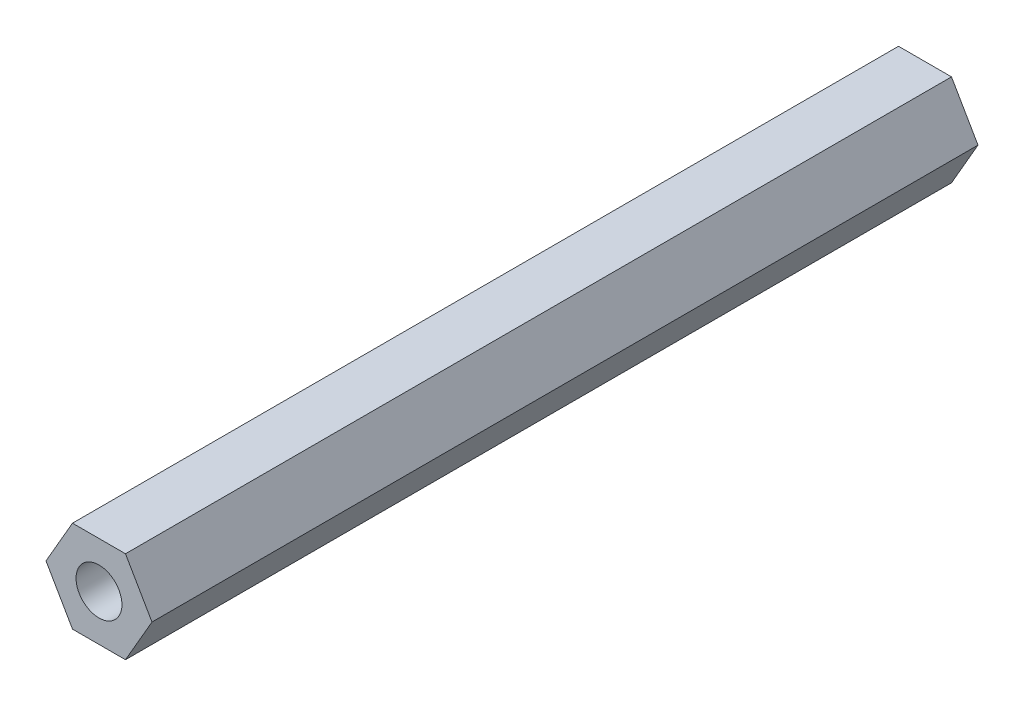
ISO-10303-21;
HEADER;
FILE_DESCRIPTION(('STEP AP214'),'2;1');
FILE_NAME('part.step','',(''),(''),'','','');
FILE_SCHEMA(('AUTOMOTIVE_DESIGN { 1 0 10303 214 1 1 1 1 }'));
ENDSEC;
DATA;
#1=APPLICATION_CONTEXT('core data for automotive mechanical design processes');
#2=APPLICATION_PROTOCOL_DEFINITION('international standard','automotive_design',2000,#1);
#3=PRODUCT_CONTEXT('',#1,'mechanical');
#4=PRODUCT('Part','Part','',(#3));
#5=PRODUCT_RELATED_PRODUCT_CATEGORY('part','',(#4));
#6=PRODUCT_DEFINITION_FORMATION('','',#4);
#7=PRODUCT_DEFINITION_CONTEXT('part definition',#1,'design');
#8=PRODUCT_DEFINITION('design','',#6,#7);
#9=PRODUCT_DEFINITION_SHAPE('','',#8);
#10=(LENGTH_UNIT() NAMED_UNIT(*) SI_UNIT(.MILLI.,.METRE.));
#11=(NAMED_UNIT(*) PLANE_ANGLE_UNIT() SI_UNIT($,.RADIAN.));
#12=(NAMED_UNIT(*) SI_UNIT($,.STERADIAN.) SOLID_ANGLE_UNIT());
#13=UNCERTAINTY_MEASURE_WITH_UNIT(LENGTH_MEASURE(1.E-05),#10,'distance_accuracy_value','');
#14=(GEOMETRIC_REPRESENTATION_CONTEXT(3) GLOBAL_UNCERTAINTY_ASSIGNED_CONTEXT((#13)) GLOBAL_UNIT_ASSIGNED_CONTEXT((#10,
#11,#12)) REPRESENTATION_CONTEXT('',''));
#15=CARTESIAN_POINT('',(0.,0.,0.));
#16=DIRECTION('',(0.,0.,1.));
#17=DIRECTION('',(1.,0.,0.));
#18=AXIS2_PLACEMENT_3D('',#15,#16,#17);
#19=CARTESIAN_POINT('',(2.88675134594813,0.,45.));
#20=DIRECTION('',(-0.866025403784438,-0.5,0.));
#21=DIRECTION('',(0.5,-0.866025403784439,0.));
#22=AXIS2_PLACEMENT_3D('',#19,#20,#21);
#23=PLANE('',#22);
#24=DIRECTION('',(-0.5,0.866025403784439,0.));
#25=VECTOR('',#24,1.);
#26=CARTESIAN_POINT('',(2.88675134594813,0.,0.));
#27=LINE('',#26,#25);
#28=CARTESIAN_POINT('',(2.88675134594813,0.,0.));
#29=VERTEX_POINT('',#28);
#30=CARTESIAN_POINT('',(1.44337567297406,2.5,0.));
#31=VERTEX_POINT('',#30);
#32=EDGE_CURVE('E125',#29,#31,#27,.T.);
#33=ORIENTED_EDGE('',*,*,#32,.T.);
#34=DIRECTION('',(0.,0.,-1.));
#35=VECTOR('',#34,1.);
#36=CARTESIAN_POINT('',(1.44337567297406,2.5,45.));
#37=LINE('',#36,#35);
#38=CARTESIAN_POINT('',(1.44337567297406,2.5,45.));
#39=VERTEX_POINT('',#38);
#40=EDGE_CURVE('E11',#39,#31,#37,.T.);
#41=ORIENTED_EDGE('',*,*,#40,.F.);
#42=DIRECTION('',(-0.5,0.866025403784439,0.));
#43=VECTOR('',#42,1.);
#44=CARTESIAN_POINT('',(2.88675134594813,0.,45.));
#45=LINE('',#44,#43);
#46=CARTESIAN_POINT('',(2.88675134594813,0.,45.));
#47=VERTEX_POINT('',#46);
#48=EDGE_CURVE('E136',#47,#39,#45,.T.);
#49=ORIENTED_EDGE('',*,*,#48,.F.);
#50=DIRECTION('',(0.,0.,-1.));
#51=VECTOR('',#50,1.);
#52=CARTESIAN_POINT('',(2.88675134594813,0.,45.));
#53=LINE('',#52,#51);
#54=EDGE_CURVE('E121',#47,#29,#53,.T.);
#55=ORIENTED_EDGE('',*,*,#54,.T.);
#56=EDGE_LOOP('',(#33,#41,#49,#55));
#57=FACE_BOUND('',#56,.T.);
#58=ADVANCED_FACE('F41',(#57),#23,.F.);
#59=CARTESIAN_POINT('',(1.44337567297406,2.5,45.));
#60=DIRECTION('',(0.,-1.,0.));
#61=DIRECTION('',(0.,0.,-1.));
#62=AXIS2_PLACEMENT_3D('',#59,#60,#61);
#63=PLANE('',#62);
#64=DIRECTION('',(-1.,0.,0.));
#65=VECTOR('',#64,1.);
#66=CARTESIAN_POINT('',(1.44337567297406,2.5,0.));
#67=LINE('',#66,#65);
#68=CARTESIAN_POINT('',(-1.44337567297406,2.5,0.));
#69=VERTEX_POINT('',#68);
#70=EDGE_CURVE('E128',#31,#69,#67,.T.);
#71=ORIENTED_EDGE('',*,*,#70,.T.);
#72=DIRECTION('',(0.,0.,-1.));
#73=VECTOR('',#72,1.);
#74=CARTESIAN_POINT('',(-1.44337567297406,2.5,45.));
#75=LINE('',#74,#73);
#76=CARTESIAN_POINT('',(-1.44337567297406,2.5,45.));
#77=VERTEX_POINT('',#76);
#78=EDGE_CURVE('E49',#77,#69,#75,.T.);
#79=ORIENTED_EDGE('',*,*,#78,.F.);
#80=DIRECTION('',(-1.,0.,0.));
#81=VECTOR('',#80,1.);
#82=CARTESIAN_POINT('',(1.44337567297406,2.5,45.));
#83=LINE('',#82,#81);
#84=EDGE_CURVE('E94',#39,#77,#83,.T.);
#85=ORIENTED_EDGE('',*,*,#84,.F.);
#86=ORIENTED_EDGE('',*,*,#40,.T.);
#87=EDGE_LOOP('',(#71,#79,#85,#86));
#88=FACE_BOUND('',#87,.T.);
#89=ADVANCED_FACE('F161',(#88),#63,.F.);
#90=CARTESIAN_POINT('',(-1.44337567297406,2.5,45.));
#91=DIRECTION('',(0.866025403784439,-0.499999999999999,0.));
#92=DIRECTION('',(0.5,0.866025403784439,0.));
#93=AXIS2_PLACEMENT_3D('',#90,#91,#92);
#94=PLANE('',#93);
#95=DIRECTION('',(-0.499999999999999,-0.866025403784439,0.));
#96=VECTOR('',#95,1.);
#97=CARTESIAN_POINT('',(-1.44337567297406,2.5,0.));
#98=LINE('',#97,#96);
#99=CARTESIAN_POINT('',(-2.88675134594813,0.,0.));
#100=VERTEX_POINT('',#99);
#101=EDGE_CURVE('E131',#69,#100,#98,.T.);
#102=ORIENTED_EDGE('',*,*,#101,.T.);
#103=DIRECTION('',(0.,0.,-1.));
#104=VECTOR('',#103,1.);
#105=CARTESIAN_POINT('',(-2.88675134594813,0.,45.));
#106=LINE('',#105,#104);
#107=CARTESIAN_POINT('',(-2.88675134594813,0.,45.));
#108=VERTEX_POINT('',#107);
#109=EDGE_CURVE('E116',#108,#100,#106,.T.);
#110=ORIENTED_EDGE('',*,*,#109,.F.);
#111=DIRECTION('',(-0.499999999999999,-0.866025403784439,0.));
#112=VECTOR('',#111,1.);
#113=CARTESIAN_POINT('',(-1.44337567297406,2.5,45.));
#114=LINE('',#113,#112);
#115=EDGE_CURVE('E107',#77,#108,#114,.T.);
#116=ORIENTED_EDGE('',*,*,#115,.F.);
#117=ORIENTED_EDGE('',*,*,#78,.T.);
#118=EDGE_LOOP('',(#102,#110,#116,#117));
#119=FACE_BOUND('',#118,.T.);
#120=ADVANCED_FACE('F142',(#119),#94,.F.);
#121=CARTESIAN_POINT('',(-2.88675134594813,0.,45.));
#122=DIRECTION('',(0.866025403784438,0.5,0.));
#123=DIRECTION('',(-0.5,0.866025403784439,0.));
#124=AXIS2_PLACEMENT_3D('',#121,#122,#123);
#125=PLANE('',#124);
#126=DIRECTION('',(0.5,-0.866025403784438,0.));
#127=VECTOR('',#126,1.);
#128=CARTESIAN_POINT('',(-2.88675134594813,0.,0.));
#129=LINE('',#128,#127);
#130=CARTESIAN_POINT('',(-1.44337567297406,-2.5,0.));
#131=VERTEX_POINT('',#130);
#132=EDGE_CURVE('E115',#100,#131,#129,.T.);
#133=ORIENTED_EDGE('',*,*,#132,.T.);
#134=DIRECTION('',(0.,0.,-1.));
#135=VECTOR('',#134,1.);
#136=CARTESIAN_POINT('',(-1.44337567297406,-2.5,45.));
#137=LINE('',#136,#135);
#138=CARTESIAN_POINT('',(-1.44337567297406,-2.5,45.));
#139=VERTEX_POINT('',#138);
#140=EDGE_CURVE('E112',#139,#131,#137,.T.);
#141=ORIENTED_EDGE('',*,*,#140,.F.);
#142=DIRECTION('',(0.5,-0.866025403784438,0.));
#143=VECTOR('',#142,1.);
#144=CARTESIAN_POINT('',(-2.88675134594813,0.,45.));
#145=LINE('',#144,#143);
#146=EDGE_CURVE('E101',#108,#139,#145,.T.);
#147=ORIENTED_EDGE('',*,*,#146,.F.);
#148=ORIENTED_EDGE('',*,*,#109,.T.);
#149=EDGE_LOOP('',(#133,#141,#147,#148));
#150=FACE_BOUND('',#149,.T.);
#151=ADVANCED_FACE('F113',(#150),#125,.F.);
#152=CARTESIAN_POINT('',(-1.44337567297406,-2.5,45.));
#153=DIRECTION('',(0.,1.,0.));
#154=DIRECTION('',(-1.,0.,0.));
#155=AXIS2_PLACEMENT_3D('',#152,#153,#154);
#156=PLANE('',#155);
#157=DIRECTION('',(1.,0.,0.));
#158=VECTOR('',#157,1.);
#159=CARTESIAN_POINT('',(-1.44337567297406,-2.5,0.));
#160=LINE('',#159,#158);
#161=CARTESIAN_POINT('',(1.44337567297407,-2.5,0.));
#162=VERTEX_POINT('',#161);
#163=EDGE_CURVE('E80',#131,#162,#160,.T.);
#164=ORIENTED_EDGE('',*,*,#163,.T.);
#165=DIRECTION('',(0.,0.,-1.));
#166=VECTOR('',#165,1.);
#167=CARTESIAN_POINT('',(1.44337567297407,-2.5,45.));
#168=LINE('',#167,#166);
#169=CARTESIAN_POINT('',(1.44337567297407,-2.5,45.));
#170=VERTEX_POINT('',#169);
#171=EDGE_CURVE('E117',#170,#162,#168,.T.);
#172=ORIENTED_EDGE('',*,*,#171,.F.);
#173=DIRECTION('',(1.,0.,0.));
#174=VECTOR('',#173,1.);
#175=CARTESIAN_POINT('',(-1.44337567297406,-2.5,45.));
#176=LINE('',#175,#174);
#177=EDGE_CURVE('E105',#139,#170,#176,.T.);
#178=ORIENTED_EDGE('',*,*,#177,.F.);
#179=ORIENTED_EDGE('',*,*,#140,.T.);
#180=EDGE_LOOP('',(#164,#172,#178,#179));
#181=FACE_BOUND('',#180,.T.);
#182=ADVANCED_FACE('F119',(#181),#156,.F.);
#183=CARTESIAN_POINT('',(1.44337567297407,-2.5,45.));
#184=DIRECTION('',(-0.866025403784439,0.5,0.));
#185=DIRECTION('',(-0.5,-0.866025403784439,0.));
#186=AXIS2_PLACEMENT_3D('',#183,#184,#185);
#187=PLANE('',#186);
#188=DIRECTION('',(0.5,0.866025403784439,0.));
#189=VECTOR('',#188,1.);
#190=CARTESIAN_POINT('',(1.44337567297407,-2.5,0.));
#191=LINE('',#190,#189);
#192=EDGE_CURVE('E86',#162,#29,#191,.T.);
#193=ORIENTED_EDGE('',*,*,#192,.T.);
#194=ORIENTED_EDGE('',*,*,#54,.F.);
#195=DIRECTION('',(0.5,0.866025403784439,0.));
#196=VECTOR('',#195,1.);
#197=CARTESIAN_POINT('',(1.44337567297407,-2.5,45.));
#198=LINE('',#197,#196);
#199=EDGE_CURVE('E57',#170,#47,#198,.T.);
#200=ORIENTED_EDGE('',*,*,#199,.F.);
#201=ORIENTED_EDGE('',*,*,#171,.T.);
#202=EDGE_LOOP('',(#193,#194,#200,#201));
#203=FACE_BOUND('',#202,.T.);
#204=ADVANCED_FACE('F149',(#203),#187,.F.);
#205=CARTESIAN_POINT('',(0.,0.,45.));
#206=DIRECTION('',(0.,0.,1.));
#207=DIRECTION('',(1.,0.,0.));
#208=AXIS2_PLACEMENT_3D('',#205,#206,#207);
#209=PLANE('',#208);
#210=CARTESIAN_POINT('',(0.,0.,45.));
#211=DIRECTION('',(0.,0.,1.));
#212=DIRECTION('',(1.,0.,0.));
#213=AXIS2_PLACEMENT_3D('',#210,#211,#212);
#214=CIRCLE('',#213,1.25);
#215=CARTESIAN_POINT('',(1.25,0.,45.));
#216=VERTEX_POINT('',#215);
#217=EDGE_CURVE('E218',#216,#216,#214,.T.);
#218=ORIENTED_EDGE('',*,*,#217,.F.);
#219=EDGE_LOOP('',(#218));
#220=FACE_BOUND('',#219,.T.);
#221=ORIENTED_EDGE('',*,*,#48,.T.);
#222=ORIENTED_EDGE('',*,*,#84,.T.);
#223=ORIENTED_EDGE('',*,*,#115,.T.);
#224=ORIENTED_EDGE('',*,*,#146,.T.);
#225=ORIENTED_EDGE('',*,*,#177,.T.);
#226=ORIENTED_EDGE('',*,*,#199,.T.);
#227=EDGE_LOOP('',(#221,#222,#223,#224,#225,#226));
#228=FACE_BOUND('',#227,.T.);
#229=ADVANCED_FACE('F103',(#220,#228),#209,.T.);
#230=CARTESIAN_POINT('',(0.,0.,0.));
#231=DIRECTION('',(0.,0.,1.));
#232=DIRECTION('',(1.,0.,0.));
#233=AXIS2_PLACEMENT_3D('',#230,#231,#232);
#234=PLANE('',#233);
#235=CARTESIAN_POINT('',(0.,0.,0.));
#236=DIRECTION('',(0.,0.,1.));
#237=DIRECTION('',(1.,0.,0.));
#238=AXIS2_PLACEMENT_3D('',#235,#236,#237);
#239=CIRCLE('',#238,1.24999999999999);
#240=CARTESIAN_POINT('',(1.24999999999999,0.,0.));
#241=VERTEX_POINT('',#240);
#242=EDGE_CURVE('E129',#241,#241,#239,.T.);
#243=ORIENTED_EDGE('',*,*,#242,.T.);
#244=EDGE_LOOP('',(#243));
#245=FACE_BOUND('',#244,.T.);
#246=ORIENTED_EDGE('',*,*,#32,.F.);
#247=ORIENTED_EDGE('',*,*,#192,.F.);
#248=ORIENTED_EDGE('',*,*,#163,.F.);
#249=ORIENTED_EDGE('',*,*,#132,.F.);
#250=ORIENTED_EDGE('',*,*,#101,.F.);
#251=ORIENTED_EDGE('',*,*,#70,.F.);
#252=EDGE_LOOP('',(#246,#247,#248,#249,#250,#251));
#253=FACE_BOUND('',#252,.T.);
#254=ADVANCED_FACE('F145',(#245,#253),#234,.F.);
#255=CARTESIAN_POINT('',(0.,0.,45.));
#256=DIRECTION('',(0.,0.,1.));
#257=DIRECTION('',(1.,0.,0.));
#258=AXIS2_PLACEMENT_3D('',#255,#256,#257);
#259=CYLINDRICAL_SURFACE('',#258,1.25);
#260=ORIENTED_EDGE('',*,*,#242,.F.);
#261=EDGE_LOOP('',(#260));
#262=FACE_BOUND('',#261,.T.);
#263=ORIENTED_EDGE('',*,*,#217,.T.);
#264=EDGE_LOOP('',(#263));
#265=FACE_BOUND('',#264,.T.);
#266=ADVANCED_FACE('F198',(#262,#265),#259,.F.);
#267=CLOSED_SHELL('',(#58,#89,#120,#151,#182,#204,#229,#254,#266));
#268=MANIFOLD_SOLID_BREP('B2',#267);
#269=ADVANCED_BREP_SHAPE_REPRESENTATION('',(#18,#268),#14);
#270=SHAPE_DEFINITION_REPRESENTATION(#9,#269);
ENDSEC;
END-ISO-10303-21;
